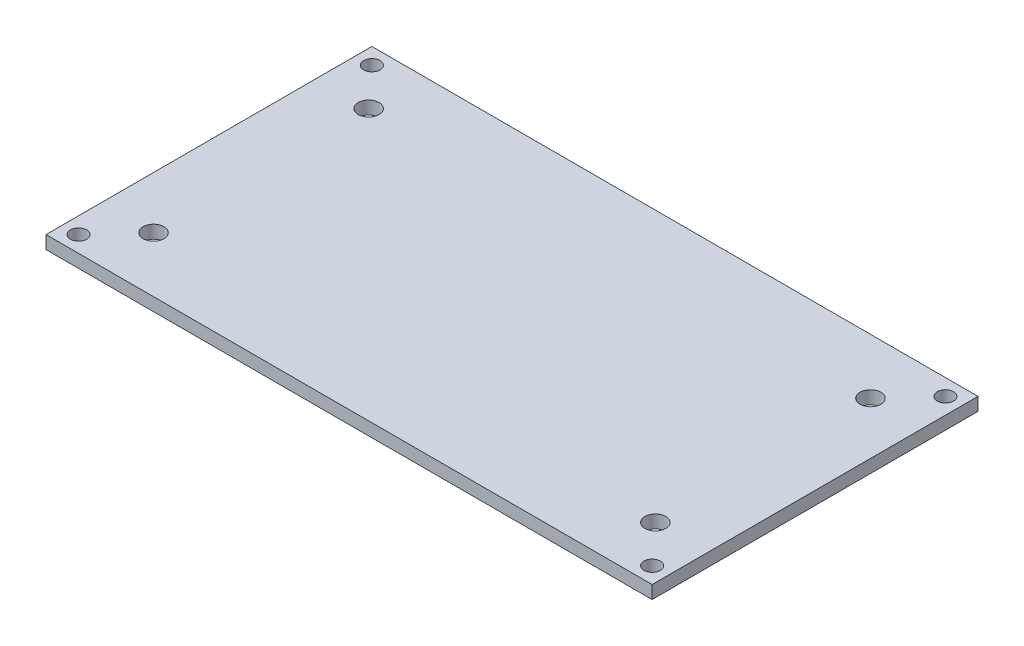
ISO-10303-21;
HEADER;
FILE_DESCRIPTION(('STEP AP214'),'2;1');
FILE_NAME('part.step','',(''),(''),'','','');
FILE_SCHEMA(('AUTOMOTIVE_DESIGN { 1 0 10303 214 1 1 1 1 }'));
ENDSEC;
DATA;
#1=APPLICATION_CONTEXT('core data for automotive mechanical design processes');
#2=APPLICATION_PROTOCOL_DEFINITION('international standard','automotive_design',2000,#1);
#3=PRODUCT_CONTEXT('',#1,'mechanical');
#4=PRODUCT('Part','Part','',(#3));
#5=PRODUCT_RELATED_PRODUCT_CATEGORY('part','',(#4));
#6=PRODUCT_DEFINITION_FORMATION('','',#4);
#7=PRODUCT_DEFINITION_CONTEXT('part definition',#1,'design');
#8=PRODUCT_DEFINITION('design','',#6,#7);
#9=PRODUCT_DEFINITION_SHAPE('','',#8);
#10=(LENGTH_UNIT() NAMED_UNIT(*) SI_UNIT(.MILLI.,.METRE.));
#11=(NAMED_UNIT(*) PLANE_ANGLE_UNIT() SI_UNIT($,.RADIAN.));
#12=(NAMED_UNIT(*) SI_UNIT($,.STERADIAN.) SOLID_ANGLE_UNIT());
#13=UNCERTAINTY_MEASURE_WITH_UNIT(LENGTH_MEASURE(1.E-05),#10,'distance_accuracy_value','');
#14=(GEOMETRIC_REPRESENTATION_CONTEXT(3) GLOBAL_UNCERTAINTY_ASSIGNED_CONTEXT((#13)) GLOBAL_UNIT_ASSIGNED_CONTEXT((#10,
#11,#12)) REPRESENTATION_CONTEXT('',''));
#15=CARTESIAN_POINT('',(0.,0.,0.));
#16=DIRECTION('',(0.,0.,1.));
#17=DIRECTION('',(1.,0.,0.));
#18=AXIS2_PLACEMENT_3D('',#15,#16,#17);
#19=CARTESIAN_POINT('',(46.5,2.,-25.));
#20=DIRECTION('',(-1.,0.,0.));
#21=DIRECTION('',(0.,0.,1.));
#22=AXIS2_PLACEMENT_3D('',#19,#20,#21);
#23=PLANE('',#22);
#24=DIRECTION('',(0.,0.,-1.));
#25=VECTOR('',#24,1.);
#26=CARTESIAN_POINT('',(46.5,0.,-25.));
#27=LINE('',#26,#25);
#28=CARTESIAN_POINT('',(46.5,0.,25.));
#29=VERTEX_POINT('',#28);
#30=CARTESIAN_POINT('',(46.5,0.,-25.));
#31=VERTEX_POINT('',#30);
#32=EDGE_CURVE('E106',#29,#31,#27,.T.);
#33=ORIENTED_EDGE('',*,*,#32,.T.);
#34=DIRECTION('',(0.,-1.,0.));
#35=VECTOR('',#34,1.);
#36=CARTESIAN_POINT('',(46.5,2.,-25.));
#37=LINE('',#36,#35);
#38=CARTESIAN_POINT('',(46.5,2.,-25.));
#39=VERTEX_POINT('',#38);
#40=EDGE_CURVE('E11',#39,#31,#37,.T.);
#41=ORIENTED_EDGE('',*,*,#40,.F.);
#42=DIRECTION('',(0.,0.,-1.));
#43=VECTOR('',#42,1.);
#44=CARTESIAN_POINT('',(46.5,2.,-25.));
#45=LINE('',#44,#43);
#46=CARTESIAN_POINT('',(46.5,2.,25.));
#47=VERTEX_POINT('',#46);
#48=EDGE_CURVE('E90',#47,#39,#45,.T.);
#49=ORIENTED_EDGE('',*,*,#48,.F.);
#50=DIRECTION('',(0.,-1.,0.));
#51=VECTOR('',#50,1.);
#52=CARTESIAN_POINT('',(46.5,2.,25.));
#53=LINE('',#52,#51);
#54=EDGE_CURVE('E102',#47,#29,#53,.T.);
#55=ORIENTED_EDGE('',*,*,#54,.T.);
#56=EDGE_LOOP('',(#33,#41,#49,#55));
#57=FACE_BOUND('',#56,.T.);
#58=ADVANCED_FACE('F38',(#57),#23,.F.);
#59=CARTESIAN_POINT('',(-46.5,2.,-25.));
#60=DIRECTION('',(0.,0.,1.));
#61=DIRECTION('',(1.,0.,0.));
#62=AXIS2_PLACEMENT_3D('',#59,#60,#61);
#63=PLANE('',#62);
#64=DIRECTION('',(-1.,0.,0.));
#65=VECTOR('',#64,1.);
#66=CARTESIAN_POINT('',(-46.5,0.,-25.));
#67=LINE('',#66,#65);
#68=CARTESIAN_POINT('',(-46.5,0.,-25.));
#69=VERTEX_POINT('',#68);
#70=EDGE_CURVE('E95',#31,#69,#67,.T.);
#71=ORIENTED_EDGE('',*,*,#70,.T.);
#72=DIRECTION('',(0.,-1.,0.));
#73=VECTOR('',#72,1.);
#74=CARTESIAN_POINT('',(-46.5,2.,-25.));
#75=LINE('',#74,#73);
#76=CARTESIAN_POINT('',(-46.5,2.,-25.));
#77=VERTEX_POINT('',#76);
#78=EDGE_CURVE('E47',#77,#69,#75,.T.);
#79=ORIENTED_EDGE('',*,*,#78,.F.);
#80=DIRECTION('',(-1.,0.,0.));
#81=VECTOR('',#80,1.);
#82=CARTESIAN_POINT('',(-46.5,2.,-25.));
#83=LINE('',#82,#81);
#84=EDGE_CURVE('E85',#39,#77,#83,.T.);
#85=ORIENTED_EDGE('',*,*,#84,.F.);
#86=ORIENTED_EDGE('',*,*,#40,.T.);
#87=EDGE_LOOP('',(#71,#79,#85,#86));
#88=FACE_BOUND('',#87,.T.);
#89=ADVANCED_FACE('F94',(#88),#63,.F.);
#90=CARTESIAN_POINT('',(-46.5,2.,-25.));
#91=DIRECTION('',(1.,0.,0.));
#92=DIRECTION('',(0.,0.,-1.));
#93=AXIS2_PLACEMENT_3D('',#90,#91,#92);
#94=PLANE('',#93);
#95=DIRECTION('',(0.,0.,1.));
#96=VECTOR('',#95,1.);
#97=CARTESIAN_POINT('',(-46.5,0.,-25.));
#98=LINE('',#97,#96);
#99=CARTESIAN_POINT('',(-46.5,0.,25.));
#100=VERTEX_POINT('',#99);
#101=EDGE_CURVE('E72',#69,#100,#98,.T.);
#102=ORIENTED_EDGE('',*,*,#101,.T.);
#103=DIRECTION('',(0.,-1.,0.));
#104=VECTOR('',#103,1.);
#105=CARTESIAN_POINT('',(-46.5,2.,25.));
#106=LINE('',#105,#104);
#107=CARTESIAN_POINT('',(-46.5,2.,25.));
#108=VERTEX_POINT('',#107);
#109=EDGE_CURVE('E97',#108,#100,#106,.T.);
#110=ORIENTED_EDGE('',*,*,#109,.F.);
#111=DIRECTION('',(0.,0.,1.));
#112=VECTOR('',#111,1.);
#113=CARTESIAN_POINT('',(-46.5,2.,-25.));
#114=LINE('',#113,#112);
#115=EDGE_CURVE('E88',#77,#108,#114,.T.);
#116=ORIENTED_EDGE('',*,*,#115,.F.);
#117=ORIENTED_EDGE('',*,*,#78,.T.);
#118=EDGE_LOOP('',(#102,#110,#116,#117));
#119=FACE_BOUND('',#118,.T.);
#120=ADVANCED_FACE('F98',(#119),#94,.F.);
#121=CARTESIAN_POINT('',(-46.5,2.,25.));
#122=DIRECTION('',(0.,0.,-1.));
#123=DIRECTION('',(-1.,0.,0.));
#124=AXIS2_PLACEMENT_3D('',#121,#122,#123);
#125=PLANE('',#124);
#126=DIRECTION('',(1.,0.,0.));
#127=VECTOR('',#126,1.);
#128=CARTESIAN_POINT('',(-46.5,0.,25.));
#129=LINE('',#128,#127);
#130=EDGE_CURVE('E78',#100,#29,#129,.T.);
#131=ORIENTED_EDGE('',*,*,#130,.T.);
#132=ORIENTED_EDGE('',*,*,#54,.F.);
#133=DIRECTION('',(1.,0.,0.));
#134=VECTOR('',#133,1.);
#135=CARTESIAN_POINT('',(-46.5,2.,25.));
#136=LINE('',#135,#134);
#137=EDGE_CURVE('E55',#108,#47,#136,.T.);
#138=ORIENTED_EDGE('',*,*,#137,.F.);
#139=ORIENTED_EDGE('',*,*,#109,.T.);
#140=EDGE_LOOP('',(#131,#132,#138,#139));
#141=FACE_BOUND('',#140,.T.);
#142=ADVANCED_FACE('F120',(#141),#125,.F.);
#143=CARTESIAN_POINT('',(0.,2.,0.));
#144=DIRECTION('',(0.,1.,0.));
#145=DIRECTION('',(0.,0.,1.));
#146=AXIS2_PLACEMENT_3D('',#143,#144,#145);
#147=PLANE('',#146);
#148=CARTESIAN_POINT('',(-38.5,2.,16.5));
#149=DIRECTION('',(0.,1.,0.));
#150=DIRECTION('',(0.,0.,1.));
#151=AXIS2_PLACEMENT_3D('',#148,#149,#150);
#152=CIRCLE('',#151,1.6);
#153=CARTESIAN_POINT('',(-38.5,2.,18.1));
#154=VERTEX_POINT('',#153);
#155=EDGE_CURVE('E176',#154,#154,#152,.T.);
#156=ORIENTED_EDGE('',*,*,#155,.F.);
#157=EDGE_LOOP('',(#156));
#158=FACE_BOUND('',#157,.T.);
#159=CARTESIAN_POINT('',(38.5,2.,-16.5));
#160=DIRECTION('',(0.,1.,0.));
#161=DIRECTION('',(0.,0.,1.));
#162=AXIS2_PLACEMENT_3D('',#159,#160,#161);
#163=CIRCLE('',#162,1.6);
#164=CARTESIAN_POINT('',(38.5,2.,-14.9));
#165=VERTEX_POINT('',#164);
#166=EDGE_CURVE('E167',#165,#165,#163,.T.);
#167=ORIENTED_EDGE('',*,*,#166,.F.);
#168=EDGE_LOOP('',(#167));
#169=FACE_BOUND('',#168,.T.);
#170=CARTESIAN_POINT('',(38.5,2.,16.5));
#171=DIRECTION('',(0.,1.,0.));
#172=DIRECTION('',(0.,0.,1.));
#173=AXIS2_PLACEMENT_3D('',#170,#171,#172);
#174=CIRCLE('',#173,1.6);
#175=CARTESIAN_POINT('',(38.5,2.,18.1));
#176=VERTEX_POINT('',#175);
#177=EDGE_CURVE('E183',#176,#176,#174,.T.);
#178=ORIENTED_EDGE('',*,*,#177,.F.);
#179=EDGE_LOOP('',(#178));
#180=FACE_BOUND('',#179,.T.);
#181=CARTESIAN_POINT('',(-38.5,2.,-16.5));
#182=DIRECTION('',(0.,1.,0.));
#183=DIRECTION('',(0.,0.,1.));
#184=AXIS2_PLACEMENT_3D('',#181,#182,#183);
#185=CIRCLE('',#184,1.6);
#186=CARTESIAN_POINT('',(-38.5,2.,-14.9));
#187=VERTEX_POINT('',#186);
#188=EDGE_CURVE('E159',#187,#187,#185,.T.);
#189=ORIENTED_EDGE('',*,*,#188,.F.);
#190=EDGE_LOOP('',(#189));
#191=FACE_BOUND('',#190,.T.);
#192=CARTESIAN_POINT('',(-44.,2.,22.5));
#193=DIRECTION('',(0.,1.,0.));
#194=DIRECTION('',(0.,0.,1.));
#195=AXIS2_PLACEMENT_3D('',#192,#193,#194);
#196=CIRCLE('',#195,1.25);
#197=CARTESIAN_POINT('',(-44.,2.,23.75));
#198=VERTEX_POINT('',#197);
#199=EDGE_CURVE('E135',#198,#198,#196,.T.);
#200=ORIENTED_EDGE('',*,*,#199,.F.);
#201=EDGE_LOOP('',(#200));
#202=FACE_BOUND('',#201,.T.);
#203=CARTESIAN_POINT('',(44.,2.,22.5));
#204=DIRECTION('',(0.,1.,0.));
#205=DIRECTION('',(0.,0.,1.));
#206=AXIS2_PLACEMENT_3D('',#203,#204,#205);
#207=CIRCLE('',#206,1.25);
#208=CARTESIAN_POINT('',(44.,2.,23.75));
#209=VERTEX_POINT('',#208);
#210=EDGE_CURVE('E144',#209,#209,#207,.T.);
#211=ORIENTED_EDGE('',*,*,#210,.F.);
#212=EDGE_LOOP('',(#211));
#213=FACE_BOUND('',#212,.T.);
#214=CARTESIAN_POINT('',(44.,2.,-22.5));
#215=DIRECTION('',(0.,1.,0.));
#216=DIRECTION('',(0.,0.,1.));
#217=AXIS2_PLACEMENT_3D('',#214,#215,#216);
#218=CIRCLE('',#217,1.25);
#219=CARTESIAN_POINT('',(44.,2.,-21.25));
#220=VERTEX_POINT('',#219);
#221=EDGE_CURVE('E152',#220,#220,#218,.T.);
#222=ORIENTED_EDGE('',*,*,#221,.F.);
#223=EDGE_LOOP('',(#222));
#224=FACE_BOUND('',#223,.T.);
#225=CARTESIAN_POINT('',(-44.,2.,-22.5));
#226=DIRECTION('',(0.,1.,0.));
#227=DIRECTION('',(0.,0.,1.));
#228=AXIS2_PLACEMENT_3D('',#225,#226,#227);
#229=CIRCLE('',#228,1.25);
#230=CARTESIAN_POINT('',(-44.,2.,-21.25));
#231=VERTEX_POINT('',#230);
#232=EDGE_CURVE('E127',#231,#231,#229,.T.);
#233=ORIENTED_EDGE('',*,*,#232,.F.);
#234=EDGE_LOOP('',(#233));
#235=FACE_BOUND('',#234,.T.);
#236=ORIENTED_EDGE('',*,*,#48,.T.);
#237=ORIENTED_EDGE('',*,*,#84,.T.);
#238=ORIENTED_EDGE('',*,*,#115,.T.);
#239=ORIENTED_EDGE('',*,*,#137,.T.);
#240=EDGE_LOOP('',(#236,#237,#238,#239));
#241=FACE_BOUND('',#240,.T.);
#242=ADVANCED_FACE('F86',(#158,#169,#180,#191,#202,#213,#224,#235,#241),#147,.T.);
#243=CARTESIAN_POINT('',(0.,0.,0.));
#244=DIRECTION('',(0.,1.,0.));
#245=DIRECTION('',(0.,0.,1.));
#246=AXIS2_PLACEMENT_3D('',#243,#244,#245);
#247=PLANE('',#246);
#248=CARTESIAN_POINT('',(-38.5,0.,16.5));
#249=DIRECTION('',(0.,1.,0.));
#250=DIRECTION('',(0.,0.,1.));
#251=AXIS2_PLACEMENT_3D('',#248,#249,#250);
#252=CIRCLE('',#251,1.6);
#253=CARTESIAN_POINT('',(-38.5,0.,18.1));
#254=VERTEX_POINT('',#253);
#255=EDGE_CURVE('E163',#254,#254,#252,.T.);
#256=ORIENTED_EDGE('',*,*,#255,.T.);
#257=EDGE_LOOP('',(#256));
#258=FACE_BOUND('',#257,.T.);
#259=CARTESIAN_POINT('',(38.5,0.,-16.5));
#260=DIRECTION('',(0.,1.,0.));
#261=DIRECTION('',(0.,0.,1.));
#262=AXIS2_PLACEMENT_3D('',#259,#260,#261);
#263=CIRCLE('',#262,1.6);
#264=CARTESIAN_POINT('',(38.5,0.,-14.9));
#265=VERTEX_POINT('',#264);
#266=EDGE_CURVE('E171',#265,#265,#263,.T.);
#267=ORIENTED_EDGE('',*,*,#266,.T.);
#268=EDGE_LOOP('',(#267));
#269=FACE_BOUND('',#268,.T.);
#270=CARTESIAN_POINT('',(38.5,0.,16.5));
#271=DIRECTION('',(0.,1.,0.));
#272=DIRECTION('',(0.,0.,1.));
#273=AXIS2_PLACEMENT_3D('',#270,#271,#272);
#274=CIRCLE('',#273,1.6);
#275=CARTESIAN_POINT('',(38.5,0.,18.1));
#276=VERTEX_POINT('',#275);
#277=EDGE_CURVE('E172',#276,#276,#274,.T.);
#278=ORIENTED_EDGE('',*,*,#277,.T.);
#279=EDGE_LOOP('',(#278));
#280=FACE_BOUND('',#279,.T.);
#281=CARTESIAN_POINT('',(-38.5,0.,-16.5));
#282=DIRECTION('',(0.,1.,0.));
#283=DIRECTION('',(0.,0.,1.));
#284=AXIS2_PLACEMENT_3D('',#281,#282,#283);
#285=CIRCLE('',#284,1.6);
#286=CARTESIAN_POINT('',(-38.5,0.,-14.9));
#287=VERTEX_POINT('',#286);
#288=EDGE_CURVE('E140',#287,#287,#285,.T.);
#289=ORIENTED_EDGE('',*,*,#288,.T.);
#290=EDGE_LOOP('',(#289));
#291=FACE_BOUND('',#290,.T.);
#292=CARTESIAN_POINT('',(-44.,0.,22.5));
#293=DIRECTION('',(0.,1.,0.));
#294=DIRECTION('',(0.,0.,1.));
#295=AXIS2_PLACEMENT_3D('',#292,#293,#294);
#296=CIRCLE('',#295,1.25);
#297=CARTESIAN_POINT('',(-44.,0.,23.75));
#298=VERTEX_POINT('',#297);
#299=EDGE_CURVE('E139',#298,#298,#296,.T.);
#300=ORIENTED_EDGE('',*,*,#299,.T.);
#301=EDGE_LOOP('',(#300));
#302=FACE_BOUND('',#301,.T.);
#303=CARTESIAN_POINT('',(44.,0.,22.5));
#304=DIRECTION('',(0.,1.,0.));
#305=DIRECTION('',(0.,0.,1.));
#306=AXIS2_PLACEMENT_3D('',#303,#304,#305);
#307=CIRCLE('',#306,1.25);
#308=CARTESIAN_POINT('',(44.,0.,23.75));
#309=VERTEX_POINT('',#308);
#310=EDGE_CURVE('E148',#309,#309,#307,.T.);
#311=ORIENTED_EDGE('',*,*,#310,.T.);
#312=EDGE_LOOP('',(#311));
#313=FACE_BOUND('',#312,.T.);
#314=CARTESIAN_POINT('',(44.,0.,-22.5));
#315=DIRECTION('',(0.,1.,0.));
#316=DIRECTION('',(0.,0.,1.));
#317=AXIS2_PLACEMENT_3D('',#314,#315,#316);
#318=CIRCLE('',#317,1.25);
#319=CARTESIAN_POINT('',(44.,0.,-21.25));
#320=VERTEX_POINT('',#319);
#321=EDGE_CURVE('E131',#320,#320,#318,.T.);
#322=ORIENTED_EDGE('',*,*,#321,.T.);
#323=EDGE_LOOP('',(#322));
#324=FACE_BOUND('',#323,.T.);
#325=CARTESIAN_POINT('',(-44.,0.,-22.5));
#326=DIRECTION('',(0.,1.,0.));
#327=DIRECTION('',(0.,0.,1.));
#328=AXIS2_PLACEMENT_3D('',#325,#326,#327);
#329=CIRCLE('',#328,1.25);
#330=CARTESIAN_POINT('',(-44.,0.,-21.25));
#331=VERTEX_POINT('',#330);
#332=EDGE_CURVE('E110',#331,#331,#329,.T.);
#333=ORIENTED_EDGE('',*,*,#332,.T.);
#334=EDGE_LOOP('',(#333));
#335=FACE_BOUND('',#334,.T.);
#336=ORIENTED_EDGE('',*,*,#32,.F.);
#337=ORIENTED_EDGE('',*,*,#130,.F.);
#338=ORIENTED_EDGE('',*,*,#101,.F.);
#339=ORIENTED_EDGE('',*,*,#70,.F.);
#340=EDGE_LOOP('',(#336,#337,#338,#339));
#341=FACE_BOUND('',#340,.T.);
#342=ADVANCED_FACE('F123',(#258,#269,#280,#291,#302,#313,#324,#335,#341),#247,.F.);
#343=CARTESIAN_POINT('',(-44.,0.,-22.5));
#344=DIRECTION('',(0.,1.,0.));
#345=DIRECTION('',(0.,0.,1.));
#346=AXIS2_PLACEMENT_3D('',#343,#344,#345);
#347=CYLINDRICAL_SURFACE('',#346,1.25);
#348=ORIENTED_EDGE('',*,*,#332,.F.);
#349=EDGE_LOOP('',(#348));
#350=FACE_BOUND('',#349,.T.);
#351=ORIENTED_EDGE('',*,*,#232,.T.);
#352=EDGE_LOOP('',(#351));
#353=FACE_BOUND('',#352,.T.);
#354=ADVANCED_FACE('F215',(#350,#353),#347,.F.);
#355=CARTESIAN_POINT('',(44.,0.,-22.5));
#356=DIRECTION('',(0.,1.,0.));
#357=DIRECTION('',(0.,0.,1.));
#358=AXIS2_PLACEMENT_3D('',#355,#356,#357);
#359=CYLINDRICAL_SURFACE('',#358,1.25);
#360=ORIENTED_EDGE('',*,*,#321,.F.);
#361=EDGE_LOOP('',(#360));
#362=FACE_BOUND('',#361,.T.);
#363=ORIENTED_EDGE('',*,*,#221,.T.);
#364=EDGE_LOOP('',(#363));
#365=FACE_BOUND('',#364,.T.);
#366=ADVANCED_FACE('F217',(#362,#365),#359,.F.);
#367=CARTESIAN_POINT('',(44.,0.,22.5));
#368=DIRECTION('',(0.,1.,0.));
#369=DIRECTION('',(0.,0.,1.));
#370=AXIS2_PLACEMENT_3D('',#367,#368,#369);
#371=CYLINDRICAL_SURFACE('',#370,1.25);
#372=ORIENTED_EDGE('',*,*,#310,.F.);
#373=EDGE_LOOP('',(#372));
#374=FACE_BOUND('',#373,.T.);
#375=ORIENTED_EDGE('',*,*,#210,.T.);
#376=EDGE_LOOP('',(#375));
#377=FACE_BOUND('',#376,.T.);
#378=ADVANCED_FACE('F224',(#374,#377),#371,.F.);
#379=CARTESIAN_POINT('',(-44.,0.,22.5));
#380=DIRECTION('',(0.,1.,0.));
#381=DIRECTION('',(0.,0.,1.));
#382=AXIS2_PLACEMENT_3D('',#379,#380,#381);
#383=CYLINDRICAL_SURFACE('',#382,1.25);
#384=ORIENTED_EDGE('',*,*,#299,.F.);
#385=EDGE_LOOP('',(#384));
#386=FACE_BOUND('',#385,.T.);
#387=ORIENTED_EDGE('',*,*,#199,.T.);
#388=EDGE_LOOP('',(#387));
#389=FACE_BOUND('',#388,.T.);
#390=ADVANCED_FACE('F266',(#386,#389),#383,.F.);
#391=CARTESIAN_POINT('',(-38.5,0.,-16.5));
#392=DIRECTION('',(0.,1.,0.));
#393=DIRECTION('',(0.,0.,1.));
#394=AXIS2_PLACEMENT_3D('',#391,#392,#393);
#395=CYLINDRICAL_SURFACE('',#394,1.6);
#396=ORIENTED_EDGE('',*,*,#288,.F.);
#397=EDGE_LOOP('',(#396));
#398=FACE_BOUND('',#397,.T.);
#399=ORIENTED_EDGE('',*,*,#188,.T.);
#400=EDGE_LOOP('',(#399));
#401=FACE_BOUND('',#400,.T.);
#402=ADVANCED_FACE('F197',(#398,#401),#395,.F.);
#403=CARTESIAN_POINT('',(38.5,0.,16.5));
#404=DIRECTION('',(0.,1.,0.));
#405=DIRECTION('',(0.,0.,1.));
#406=AXIS2_PLACEMENT_3D('',#403,#404,#405);
#407=CYLINDRICAL_SURFACE('',#406,1.6);
#408=ORIENTED_EDGE('',*,*,#277,.F.);
#409=EDGE_LOOP('',(#408));
#410=FACE_BOUND('',#409,.T.);
#411=ORIENTED_EDGE('',*,*,#177,.T.);
#412=EDGE_LOOP('',(#411));
#413=FACE_BOUND('',#412,.T.);
#414=ADVANCED_FACE('F193',(#410,#413),#407,.F.);
#415=CARTESIAN_POINT('',(38.5,0.,-16.5));
#416=DIRECTION('',(0.,1.,0.));
#417=DIRECTION('',(0.,0.,1.));
#418=AXIS2_PLACEMENT_3D('',#415,#416,#417);
#419=CYLINDRICAL_SURFACE('',#418,1.6);
#420=ORIENTED_EDGE('',*,*,#266,.F.);
#421=EDGE_LOOP('',(#420));
#422=FACE_BOUND('',#421,.T.);
#423=ORIENTED_EDGE('',*,*,#166,.T.);
#424=EDGE_LOOP('',(#423));
#425=FACE_BOUND('',#424,.T.);
#426=ADVANCED_FACE('F196',(#422,#425),#419,.F.);
#427=CARTESIAN_POINT('',(-38.5,0.,16.5));
#428=DIRECTION('',(0.,1.,0.));
#429=DIRECTION('',(0.,0.,1.));
#430=AXIS2_PLACEMENT_3D('',#427,#428,#429);
#431=CYLINDRICAL_SURFACE('',#430,1.6);
#432=ORIENTED_EDGE('',*,*,#255,.F.);
#433=EDGE_LOOP('',(#432));
#434=FACE_BOUND('',#433,.T.);
#435=ORIENTED_EDGE('',*,*,#155,.T.);
#436=EDGE_LOOP('',(#435));
#437=FACE_BOUND('',#436,.T.);
#438=ADVANCED_FACE('F284',(#434,#437),#431,.F.);
#439=CLOSED_SHELL('',(#58,#89,#120,#142,#242,#342,#354,#366,#378,#390,#402,#414,#426,#438));
#440=MANIFOLD_SOLID_BREP('B2',#439);
#441=ADVANCED_BREP_SHAPE_REPRESENTATION('',(#18,#440),#14);
#442=SHAPE_DEFINITION_REPRESENTATION(#9,#441);
ENDSEC;
END-ISO-10303-21;
